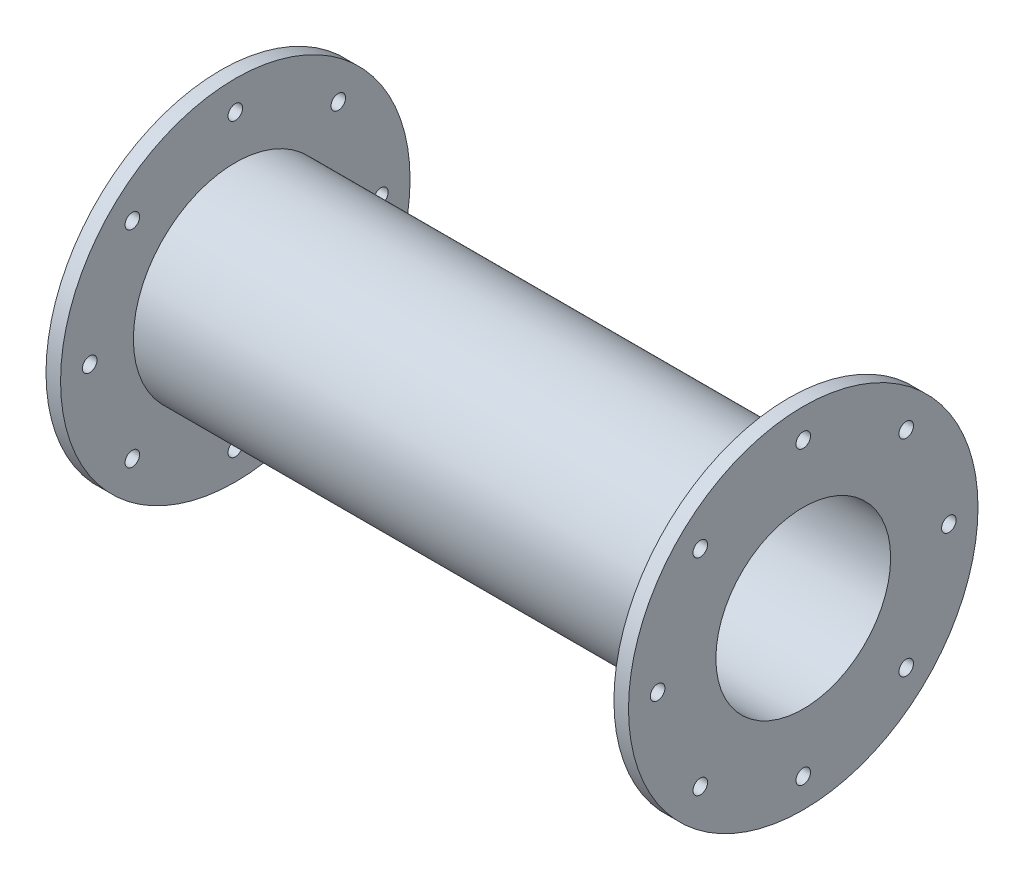
ISO-10303-21;
HEADER;
FILE_DESCRIPTION(('STEP AP214'),'2;1');
FILE_NAME('part.step','',(''),(''),'','','');
FILE_SCHEMA(('AUTOMOTIVE_DESIGN { 1 0 10303 214 1 1 1 1 }'));
ENDSEC;
DATA;
#1=APPLICATION_CONTEXT('core data for automotive mechanical design processes');
#2=APPLICATION_PROTOCOL_DEFINITION('international standard','automotive_design',2000,#1);
#3=PRODUCT_CONTEXT('',#1,'mechanical');
#4=PRODUCT('Part','Part','',(#3));
#5=PRODUCT_RELATED_PRODUCT_CATEGORY('part','',(#4));
#6=PRODUCT_DEFINITION_FORMATION('','',#4);
#7=PRODUCT_DEFINITION_CONTEXT('part definition',#1,'design');
#8=PRODUCT_DEFINITION('design','',#6,#7);
#9=PRODUCT_DEFINITION_SHAPE('','',#8);
#10=(LENGTH_UNIT() NAMED_UNIT(*) SI_UNIT(.MILLI.,.METRE.));
#11=(NAMED_UNIT(*) PLANE_ANGLE_UNIT() SI_UNIT($,.RADIAN.));
#12=(NAMED_UNIT(*) SI_UNIT($,.STERADIAN.) SOLID_ANGLE_UNIT());
#13=UNCERTAINTY_MEASURE_WITH_UNIT(LENGTH_MEASURE(1.E-05),#10,'distance_accuracy_value','');
#14=(GEOMETRIC_REPRESENTATION_CONTEXT(3) GLOBAL_UNCERTAINTY_ASSIGNED_CONTEXT((#13)) GLOBAL_UNIT_ASSIGNED_CONTEXT((#10,
#11,#12)) REPRESENTATION_CONTEXT('',''));
#15=CARTESIAN_POINT('',(0.,0.,0.));
#16=DIRECTION('',(0.,0.,1.));
#17=DIRECTION('',(1.,0.,0.));
#18=AXIS2_PLACEMENT_3D('',#15,#16,#17);
#19=CARTESIAN_POINT('',(-152.49,0.,0.));
#20=DIRECTION('',(-1.,0.,0.));
#21=DIRECTION('',(0.,0.,1.));
#22=AXIS2_PLACEMENT_3D('',#19,#20,#21);
#23=CYLINDRICAL_SURFACE('',#22,38.1);
#24=CARTESIAN_POINT('',(-3.17499999999998,0.,0.));
#25=DIRECTION('',(-1.,0.,0.));
#26=DIRECTION('',(0.,0.,1.));
#27=AXIS2_PLACEMENT_3D('',#24,#25,#26);
#28=CIRCLE('',#27,38.1);
#29=CARTESIAN_POINT('',(-3.17499999999998,0.,38.1));
#30=VERTEX_POINT('',#29);
#31=EDGE_CURVE('E72',#30,#30,#28,.T.);
#32=ORIENTED_EDGE('',*,*,#31,.F.);
#33=EDGE_LOOP('',(#32));
#34=FACE_BOUND('',#33,.T.);
#35=CARTESIAN_POINT('',(0.,0.,0.));
#36=DIRECTION('',(-1.,0.,0.));
#37=DIRECTION('',(0.,0.,1.));
#38=AXIS2_PLACEMENT_3D('',#35,#36,#37);
#39=CIRCLE('',#38,38.1);
#40=CARTESIAN_POINT('',(0.,0.,38.1));
#41=VERTEX_POINT('',#40);
#42=EDGE_CURVE('E10',#41,#41,#39,.T.);
#43=ORIENTED_EDGE('',*,*,#42,.T.);
#44=EDGE_LOOP('',(#43));
#45=FACE_BOUND('',#44,.T.);
#46=ADVANCED_FACE('F37',(#34,#45),#23,.T.);
#47=CARTESIAN_POINT('',(0.,38.1,0.));
#48=DIRECTION('',(-1.,0.,0.));
#49=DIRECTION('',(0.,0.,1.));
#50=AXIS2_PLACEMENT_3D('',#47,#48,#49);
#51=PLANE('',#50);
#52=CARTESIAN_POINT('',(0.,-1.10854532508269E-13,31.75));
#53=DIRECTION('',(1.,0.,0.));
#54=DIRECTION('',(0.,1.,0.));
#55=AXIS2_PLACEMENT_3D('',#52,#53,#54);
#56=CIRCLE('',#55,1.58749999999999);
#57=CARTESIAN_POINT('',(0.,1.58749999999988,31.75));
#58=VERTEX_POINT('',#57);
#59=EDGE_CURVE('E179',#58,#58,#56,.T.);
#60=ORIENTED_EDGE('',*,*,#59,.F.);
#61=EDGE_LOOP('',(#60));
#62=FACE_BOUND('',#61,.T.);
#63=CARTESIAN_POINT('',(0.,-22.450640302673,22.4506403026728));
#64=DIRECTION('',(1.,0.,0.));
#65=DIRECTION('',(0.,0.707106781186544,0.707106781186551));
#66=AXIS2_PLACEMENT_3D('',#63,#64,#65);
#67=CIRCLE('',#66,1.58749999999999);
#68=CARTESIAN_POINT('',(0.,-21.3281082875394,23.5731723178064));
#69=VERTEX_POINT('',#68);
#70=EDGE_CURVE('E171',#69,#69,#67,.T.);
#71=ORIENTED_EDGE('',*,*,#70,.F.);
#72=EDGE_LOOP('',(#71));
#73=FACE_BOUND('',#72,.T.);
#74=CARTESIAN_POINT('',(0.,-31.75,0.));
#75=DIRECTION('',(1.,0.,0.));
#76=DIRECTION('',(0.,0.,1.));
#77=AXIS2_PLACEMENT_3D('',#74,#75,#76);
#78=CIRCLE('',#77,1.58749999999999);
#79=CARTESIAN_POINT('',(0.,-31.75,1.58749999999999));
#80=VERTEX_POINT('',#79);
#81=EDGE_CURVE('E161',#80,#80,#78,.T.);
#82=ORIENTED_EDGE('',*,*,#81,.F.);
#83=EDGE_LOOP('',(#82));
#84=FACE_BOUND('',#83,.T.);
#85=CARTESIAN_POINT('',(0.,-22.4506403026727,-22.4506403026731));
#86=DIRECTION('',(1.,0.,0.));
#87=DIRECTION('',(0.,-0.707106781186554,0.707106781186541));
#88=AXIS2_PLACEMENT_3D('',#85,#86,#87);
#89=CIRCLE('',#88,1.58749999999999);
#90=CARTESIAN_POINT('',(0.,-23.5731723178063,-21.3281082875395));
#91=VERTEX_POINT('',#90);
#92=EDGE_CURVE('E162',#91,#91,#89,.T.);
#93=ORIENTED_EDGE('',*,*,#92,.F.);
#94=EDGE_LOOP('',(#93));
#95=FACE_BOUND('',#94,.T.);
#96=CARTESIAN_POINT('',(0.,3.32563597524808E-13,-31.75));
#97=DIRECTION('',(1.,0.,0.));
#98=DIRECTION('',(0.,-1.,0.));
#99=AXIS2_PLACEMENT_3D('',#96,#97,#98);
#100=CIRCLE('',#99,1.58749999999999);
#101=CARTESIAN_POINT('',(0.,-1.58749999999966,-31.75));
#102=VERTEX_POINT('',#101);
#103=EDGE_CURVE('E193',#102,#102,#100,.T.);
#104=ORIENTED_EDGE('',*,*,#103,.F.);
#105=EDGE_LOOP('',(#104));
#106=FACE_BOUND('',#105,.T.);
#107=CARTESIAN_POINT('',(0.,22.4506403026732,-22.4506403026726));
#108=DIRECTION('',(1.,0.,0.));
#109=DIRECTION('',(0.,-0.707106781186539,-0.707106781186556));
#110=AXIS2_PLACEMENT_3D('',#107,#108,#109);
#111=CIRCLE('',#110,1.58749999999999);
#112=CARTESIAN_POINT('',(0.,21.3281082875395,-23.5731723178063));
#113=VERTEX_POINT('',#112);
#114=EDGE_CURVE('E194',#113,#113,#111,.T.);
#115=ORIENTED_EDGE('',*,*,#114,.F.);
#116=EDGE_LOOP('',(#115));
#117=FACE_BOUND('',#116,.T.);
#118=CARTESIAN_POINT('',(0.,22.4506403026728,22.4506403026729));
#119=DIRECTION('',(1.,0.,0.));
#120=DIRECTION('',(0.,0.707106781186549,-0.707106781186546));
#121=AXIS2_PLACEMENT_3D('',#118,#119,#120);
#122=CIRCLE('',#121,1.58749999999999);
#123=CARTESIAN_POINT('',(0.,23.5731723178065,21.3281082875393));
#124=VERTEX_POINT('',#123);
#125=EDGE_CURVE('E152',#124,#124,#122,.T.);
#126=ORIENTED_EDGE('',*,*,#125,.F.);
#127=EDGE_LOOP('',(#126));
#128=FACE_BOUND('',#127,.T.);
#129=CARTESIAN_POINT('',(0.,31.75,0.));
#130=DIRECTION('',(1.,0.,0.));
#131=DIRECTION('',(0.,0.,-1.));
#132=AXIS2_PLACEMENT_3D('',#129,#130,#131);
#133=CIRCLE('',#132,1.58749999999999);
#134=CARTESIAN_POINT('',(0.,31.75,-1.58749999999999));
#135=VERTEX_POINT('',#134);
#136=EDGE_CURVE('E88',#135,#135,#133,.T.);
#137=ORIENTED_EDGE('',*,*,#136,.F.);
#138=EDGE_LOOP('',(#137));
#139=FACE_BOUND('',#138,.T.);
#140=ORIENTED_EDGE('',*,*,#42,.F.);
#141=EDGE_LOOP('',(#140));
#142=FACE_BOUND('',#141,.T.);
#143=CARTESIAN_POINT('',(0.,0.,0.));
#144=DIRECTION('',(-1.,0.,0.));
#145=DIRECTION('',(0.,0.,1.));
#146=AXIS2_PLACEMENT_3D('',#143,#144,#145);
#147=CIRCLE('',#146,19.05);
#148=CARTESIAN_POINT('',(0.,0.,19.05));
#149=VERTEX_POINT('',#148);
#150=EDGE_CURVE('E44',#149,#149,#147,.T.);
#151=ORIENTED_EDGE('',*,*,#150,.T.);
#152=EDGE_LOOP('',(#151));
#153=FACE_BOUND('',#152,.T.);
#154=ADVANCED_FACE('F208',(#62,#73,#84,#95,#106,#117,#128,#139,#142,#153),#51,.F.);
#155=CARTESIAN_POINT('',(-152.49,0.,0.));
#156=DIRECTION('',(-1.,0.,0.));
#157=DIRECTION('',(0.,0.,1.));
#158=AXIS2_PLACEMENT_3D('',#155,#156,#157);
#159=CYLINDRICAL_SURFACE('',#158,19.05);
#160=ORIENTED_EDGE('',*,*,#150,.F.);
#161=EDGE_LOOP('',(#160));
#162=FACE_BOUND('',#161,.T.);
#163=CARTESIAN_POINT('',(-127.,0.,0.));
#164=DIRECTION('',(-1.,0.,0.));
#165=DIRECTION('',(0.,0.,1.));
#166=AXIS2_PLACEMENT_3D('',#163,#164,#165);
#167=CIRCLE('',#166,19.05);
#168=CARTESIAN_POINT('',(-127.,0.,19.05));
#169=VERTEX_POINT('',#168);
#170=EDGE_CURVE('E49',#169,#169,#167,.T.);
#171=ORIENTED_EDGE('',*,*,#170,.T.);
#172=EDGE_LOOP('',(#171));
#173=FACE_BOUND('',#172,.T.);
#174=ADVANCED_FACE('F211',(#162,#173),#159,.F.);
#175=CARTESIAN_POINT('',(-127.,19.05,0.));
#176=DIRECTION('',(1.,0.,0.));
#177=DIRECTION('',(0.,0.,-1.));
#178=AXIS2_PLACEMENT_3D('',#175,#176,#177);
#179=PLANE('',#178);
#180=CARTESIAN_POINT('',(-127.,-1.10854532508269E-13,31.75));
#181=DIRECTION('',(1.,0.,0.));
#182=DIRECTION('',(0.,1.,0.));
#183=AXIS2_PLACEMENT_3D('',#180,#181,#182);
#184=CIRCLE('',#183,1.58749999999998);
#185=CARTESIAN_POINT('',(-127.,1.58749999999987,31.75));
#186=VERTEX_POINT('',#185);
#187=EDGE_CURVE('E123',#186,#186,#184,.T.);
#188=ORIENTED_EDGE('',*,*,#187,.T.);
#189=EDGE_LOOP('',(#188));
#190=FACE_BOUND('',#189,.T.);
#191=CARTESIAN_POINT('',(-127.,-22.450640302673,22.4506403026728));
#192=DIRECTION('',(1.,0.,0.));
#193=DIRECTION('',(0.,0.707106781186544,0.707106781186551));
#194=AXIS2_PLACEMENT_3D('',#191,#192,#193);
#195=CIRCLE('',#194,1.58749999999998);
#196=CARTESIAN_POINT('',(-127.,-21.3281082875394,23.5731723178064));
#197=VERTEX_POINT('',#196);
#198=EDGE_CURVE('E115',#197,#197,#195,.T.);
#199=ORIENTED_EDGE('',*,*,#198,.T.);
#200=EDGE_LOOP('',(#199));
#201=FACE_BOUND('',#200,.T.);
#202=CARTESIAN_POINT('',(-127.,-31.75,0.));
#203=DIRECTION('',(1.,0.,0.));
#204=DIRECTION('',(0.,0.,1.));
#205=AXIS2_PLACEMENT_3D('',#202,#203,#204);
#206=CIRCLE('',#205,1.58749999999998);
#207=CARTESIAN_POINT('',(-127.,-31.75,1.58749999999998));
#208=VERTEX_POINT('',#207);
#209=EDGE_CURVE('E105',#208,#208,#206,.T.);
#210=ORIENTED_EDGE('',*,*,#209,.T.);
#211=EDGE_LOOP('',(#210));
#212=FACE_BOUND('',#211,.T.);
#213=CARTESIAN_POINT('',(-127.,-22.4506403026727,-22.4506403026731));
#214=DIRECTION('',(1.,0.,0.));
#215=DIRECTION('',(0.,-0.707106781186554,0.707106781186541));
#216=AXIS2_PLACEMENT_3D('',#213,#214,#215);
#217=CIRCLE('',#216,1.58749999999998);
#218=CARTESIAN_POINT('',(-127.,-23.5731723178063,-21.3281082875395));
#219=VERTEX_POINT('',#218);
#220=EDGE_CURVE('E106',#219,#219,#217,.T.);
#221=ORIENTED_EDGE('',*,*,#220,.T.);
#222=EDGE_LOOP('',(#221));
#223=FACE_BOUND('',#222,.T.);
#224=CARTESIAN_POINT('',(-127.,3.32563597524808E-13,-31.75));
#225=DIRECTION('',(1.,0.,0.));
#226=DIRECTION('',(0.,-1.,0.));
#227=AXIS2_PLACEMENT_3D('',#224,#225,#226);
#228=CIRCLE('',#227,1.58749999999998);
#229=CARTESIAN_POINT('',(-127.,-1.58749999999965,-31.75));
#230=VERTEX_POINT('',#229);
#231=EDGE_CURVE('E137',#230,#230,#228,.T.);
#232=ORIENTED_EDGE('',*,*,#231,.T.);
#233=EDGE_LOOP('',(#232));
#234=FACE_BOUND('',#233,.T.);
#235=CARTESIAN_POINT('',(-127.,22.4506403026732,-22.4506403026726));
#236=DIRECTION('',(1.,0.,0.));
#237=DIRECTION('',(0.,-0.707106781186539,-0.707106781186556));
#238=AXIS2_PLACEMENT_3D('',#235,#236,#237);
#239=CIRCLE('',#238,1.58749999999998);
#240=CARTESIAN_POINT('',(-127.,21.3281082875395,-23.5731723178063));
#241=VERTEX_POINT('',#240);
#242=EDGE_CURVE('E138',#241,#241,#239,.T.);
#243=ORIENTED_EDGE('',*,*,#242,.T.);
#244=EDGE_LOOP('',(#243));
#245=FACE_BOUND('',#244,.T.);
#246=CARTESIAN_POINT('',(-127.,22.4506403026728,22.4506403026729));
#247=DIRECTION('',(1.,0.,0.));
#248=DIRECTION('',(0.,0.707106781186549,-0.707106781186546));
#249=AXIS2_PLACEMENT_3D('',#246,#247,#248);
#250=CIRCLE('',#249,1.58749999999998);
#251=CARTESIAN_POINT('',(-127.,23.5731723178065,21.3281082875393));
#252=VERTEX_POINT('',#251);
#253=EDGE_CURVE('E96',#252,#252,#250,.T.);
#254=ORIENTED_EDGE('',*,*,#253,.T.);
#255=EDGE_LOOP('',(#254));
#256=FACE_BOUND('',#255,.T.);
#257=CARTESIAN_POINT('',(-127.,31.75,0.));
#258=DIRECTION('',(1.,0.,0.));
#259=DIRECTION('',(0.,0.,-1.));
#260=AXIS2_PLACEMENT_3D('',#257,#258,#259);
#261=CIRCLE('',#260,1.58749999999998);
#262=CARTESIAN_POINT('',(-127.,31.75,-1.58749999999998));
#263=VERTEX_POINT('',#262);
#264=EDGE_CURVE('E84',#263,#263,#261,.T.);
#265=ORIENTED_EDGE('',*,*,#264,.T.);
#266=EDGE_LOOP('',(#265));
#267=FACE_BOUND('',#266,.T.);
#268=ORIENTED_EDGE('',*,*,#170,.F.);
#269=EDGE_LOOP('',(#268));
#270=FACE_BOUND('',#269,.T.);
#271=CARTESIAN_POINT('',(-127.,0.,0.));
#272=DIRECTION('',(-1.,0.,0.));
#273=DIRECTION('',(0.,0.,1.));
#274=AXIS2_PLACEMENT_3D('',#271,#272,#273);
#275=CIRCLE('',#274,38.1);
#276=CARTESIAN_POINT('',(-127.,0.,38.1));
#277=VERTEX_POINT('',#276);
#278=EDGE_CURVE('E54',#277,#277,#275,.T.);
#279=ORIENTED_EDGE('',*,*,#278,.T.);
#280=EDGE_LOOP('',(#279));
#281=FACE_BOUND('',#280,.T.);
#282=ADVANCED_FACE('F252',(#190,#201,#212,#223,#234,#245,#256,#267,#270,#281),#179,.F.);
#283=CARTESIAN_POINT('',(-152.49,0.,0.));
#284=DIRECTION('',(-1.,0.,0.));
#285=DIRECTION('',(0.,0.,1.));
#286=AXIS2_PLACEMENT_3D('',#283,#284,#285);
#287=CYLINDRICAL_SURFACE('',#286,38.1);
#288=ORIENTED_EDGE('',*,*,#278,.F.);
#289=EDGE_LOOP('',(#288));
#290=FACE_BOUND('',#289,.T.);
#291=CARTESIAN_POINT('',(-123.825,0.,0.));
#292=DIRECTION('',(-1.,0.,0.));
#293=DIRECTION('',(0.,0.,1.));
#294=AXIS2_PLACEMENT_3D('',#291,#292,#293);
#295=CIRCLE('',#294,38.1);
#296=CARTESIAN_POINT('',(-123.825,0.,38.1));
#297=VERTEX_POINT('',#296);
#298=EDGE_CURVE('E60',#297,#297,#295,.T.);
#299=ORIENTED_EDGE('',*,*,#298,.T.);
#300=EDGE_LOOP('',(#299));
#301=FACE_BOUND('',#300,.T.);
#302=ADVANCED_FACE('F260',(#290,#301),#287,.T.);
#303=CARTESIAN_POINT('',(-123.825,38.1,0.));
#304=DIRECTION('',(-1.,0.,0.));
#305=DIRECTION('',(0.,0.,1.));
#306=AXIS2_PLACEMENT_3D('',#303,#304,#305);
#307=PLANE('',#306);
#308=CARTESIAN_POINT('',(-123.825,-1.10854532508269E-13,31.75));
#309=DIRECTION('',(-1.,0.,0.));
#310=DIRECTION('',(0.,-1.,0.));
#311=AXIS2_PLACEMENT_3D('',#308,#309,#310);
#312=CIRCLE('',#311,1.58749999999999);
#313=CARTESIAN_POINT('',(-123.825,-1.5875000000001,31.75));
#314=VERTEX_POINT('',#313);
#315=EDGE_CURVE('E100',#314,#314,#312,.T.);
#316=ORIENTED_EDGE('',*,*,#315,.T.);
#317=EDGE_LOOP('',(#316));
#318=FACE_BOUND('',#317,.T.);
#319=CARTESIAN_POINT('',(-123.825,-22.450640302673,22.4506403026728));
#320=DIRECTION('',(-1.,0.,0.));
#321=DIRECTION('',(0.,-0.707106781186544,-0.707106781186551));
#322=AXIS2_PLACEMENT_3D('',#319,#320,#321);
#323=CIRCLE('',#322,1.58749999999999);
#324=CARTESIAN_POINT('',(-123.825,-23.5731723178066,21.3281082875391));
#325=VERTEX_POINT('',#324);
#326=EDGE_CURVE('E119',#325,#325,#323,.T.);
#327=ORIENTED_EDGE('',*,*,#326,.T.);
#328=EDGE_LOOP('',(#327));
#329=FACE_BOUND('',#328,.T.);
#330=CARTESIAN_POINT('',(-123.825,-31.75,0.));
#331=DIRECTION('',(-1.,0.,0.));
#332=DIRECTION('',(0.,0.,-1.));
#333=AXIS2_PLACEMENT_3D('',#330,#331,#332);
#334=CIRCLE('',#333,1.58749999999999);
#335=CARTESIAN_POINT('',(-123.825,-31.75,-1.58749999999999));
#336=VERTEX_POINT('',#335);
#337=EDGE_CURVE('E111',#336,#336,#334,.T.);
#338=ORIENTED_EDGE('',*,*,#337,.T.);
#339=EDGE_LOOP('',(#338));
#340=FACE_BOUND('',#339,.T.);
#341=CARTESIAN_POINT('',(-123.825,-22.4506403026727,-22.4506403026731));
#342=DIRECTION('',(-1.,0.,0.));
#343=DIRECTION('',(0.,0.707106781186554,-0.707106781186541));
#344=AXIS2_PLACEMENT_3D('',#341,#342,#343);
#345=CIRCLE('',#344,1.58749999999999);
#346=CARTESIAN_POINT('',(-123.825,-21.328108287539,-23.5731723178067));
#347=VERTEX_POINT('',#346);
#348=EDGE_CURVE('E101',#347,#347,#345,.T.);
#349=ORIENTED_EDGE('',*,*,#348,.T.);
#350=EDGE_LOOP('',(#349));
#351=FACE_BOUND('',#350,.T.);
#352=CARTESIAN_POINT('',(-123.825,3.32563597524808E-13,-31.75));
#353=DIRECTION('',(-1.,0.,0.));
#354=DIRECTION('',(0.,1.,0.));
#355=AXIS2_PLACEMENT_3D('',#352,#353,#354);
#356=CIRCLE('',#355,1.58749999999999);
#357=CARTESIAN_POINT('',(-123.825,1.58750000000032,-31.75));
#358=VERTEX_POINT('',#357);
#359=EDGE_CURVE('E110',#358,#358,#356,.T.);
#360=ORIENTED_EDGE('',*,*,#359,.T.);
#361=EDGE_LOOP('',(#360));
#362=FACE_BOUND('',#361,.T.);
#363=CARTESIAN_POINT('',(-123.825,22.4506403026732,-22.4506403026726));
#364=DIRECTION('',(-1.,0.,0.));
#365=DIRECTION('',(0.,0.707106781186539,0.707106781186556));
#366=AXIS2_PLACEMENT_3D('',#363,#364,#365);
#367=CIRCLE('',#366,1.58749999999999);
#368=CARTESIAN_POINT('',(-123.825,23.5731723178068,-21.328108287539));
#369=VERTEX_POINT('',#368);
#370=EDGE_CURVE('E133',#369,#369,#367,.T.);
#371=ORIENTED_EDGE('',*,*,#370,.T.);
#372=EDGE_LOOP('',(#371));
#373=FACE_BOUND('',#372,.T.);
#374=CARTESIAN_POINT('',(-123.825,22.4506403026728,22.4506403026729));
#375=DIRECTION('',(-1.,0.,0.));
#376=DIRECTION('',(0.,-0.707106781186549,0.707106781186546));
#377=AXIS2_PLACEMENT_3D('',#374,#375,#376);
#378=CIRCLE('',#377,1.58749999999999);
#379=CARTESIAN_POINT('',(-123.825,21.3281082875392,23.5731723178066));
#380=VERTEX_POINT('',#379);
#381=EDGE_CURVE('E92',#380,#380,#378,.T.);
#382=ORIENTED_EDGE('',*,*,#381,.T.);
#383=EDGE_LOOP('',(#382));
#384=FACE_BOUND('',#383,.T.);
#385=CARTESIAN_POINT('',(-123.825,31.75,0.));
#386=DIRECTION('',(-1.,0.,0.));
#387=DIRECTION('',(0.,0.,1.));
#388=AXIS2_PLACEMENT_3D('',#385,#386,#387);
#389=CIRCLE('',#388,1.58749999999999);
#390=CARTESIAN_POINT('',(-123.825,31.75,1.58749999999999));
#391=VERTEX_POINT('',#390);
#392=EDGE_CURVE('E76',#391,#391,#389,.T.);
#393=ORIENTED_EDGE('',*,*,#392,.T.);
#394=EDGE_LOOP('',(#393));
#395=FACE_BOUND('',#394,.T.);
#396=ORIENTED_EDGE('',*,*,#298,.F.);
#397=EDGE_LOOP('',(#396));
#398=FACE_BOUND('',#397,.T.);
#399=CARTESIAN_POINT('',(-123.825,0.,0.));
#400=DIRECTION('',(-1.,0.,0.));
#401=DIRECTION('',(0.,0.,1.));
#402=AXIS2_PLACEMENT_3D('',#399,#400,#401);
#403=CIRCLE('',#402,22.225);
#404=CARTESIAN_POINT('',(-123.825,0.,22.225));
#405=VERTEX_POINT('',#404);
#406=EDGE_CURVE('E64',#405,#405,#403,.T.);
#407=ORIENTED_EDGE('',*,*,#406,.T.);
#408=EDGE_LOOP('',(#407));
#409=FACE_BOUND('',#408,.T.);
#410=ADVANCED_FACE('F268',(#318,#329,#340,#351,#362,#373,#384,#395,#398,#409),#307,.F.);
#411=CARTESIAN_POINT('',(-152.49,0.,0.));
#412=DIRECTION('',(-1.,0.,0.));
#413=DIRECTION('',(0.,0.,1.));
#414=AXIS2_PLACEMENT_3D('',#411,#412,#413);
#415=CYLINDRICAL_SURFACE('',#414,22.225);
#416=ORIENTED_EDGE('',*,*,#406,.F.);
#417=EDGE_LOOP('',(#416));
#418=FACE_BOUND('',#417,.T.);
#419=CARTESIAN_POINT('',(-3.17499999999998,0.,0.));
#420=DIRECTION('',(-1.,0.,0.));
#421=DIRECTION('',(0.,0.,1.));
#422=AXIS2_PLACEMENT_3D('',#419,#420,#421);
#423=CIRCLE('',#422,22.225);
#424=CARTESIAN_POINT('',(-3.17499999999998,0.,22.225));
#425=VERTEX_POINT('',#424);
#426=EDGE_CURVE('E68',#425,#425,#423,.T.);
#427=ORIENTED_EDGE('',*,*,#426,.T.);
#428=EDGE_LOOP('',(#427));
#429=FACE_BOUND('',#428,.T.);
#430=ADVANCED_FACE('F230',(#418,#429),#415,.T.);
#431=CARTESIAN_POINT('',(-3.17499999999999,22.225,0.));
#432=DIRECTION('',(1.,0.,0.));
#433=DIRECTION('',(0.,0.,-1.));
#434=AXIS2_PLACEMENT_3D('',#431,#432,#433);
#435=PLANE('',#434);
#436=CARTESIAN_POINT('',(-3.17499999999999,-1.10854532508269E-13,31.75));
#437=DIRECTION('',(1.,0.,0.));
#438=DIRECTION('',(0.,1.,0.));
#439=AXIS2_PLACEMENT_3D('',#436,#437,#438);
#440=CIRCLE('',#439,1.58749999999999);
#441=CARTESIAN_POINT('',(-3.17499999999999,1.58749999999988,31.75));
#442=VERTEX_POINT('',#441);
#443=EDGE_CURVE('E156',#442,#442,#440,.T.);
#444=ORIENTED_EDGE('',*,*,#443,.T.);
#445=EDGE_LOOP('',(#444));
#446=FACE_BOUND('',#445,.T.);
#447=CARTESIAN_POINT('',(-3.17499999999999,-22.450640302673,22.4506403026728));
#448=DIRECTION('',(1.,0.,0.));
#449=DIRECTION('',(0.,0.707106781186544,0.707106781186551));
#450=AXIS2_PLACEMENT_3D('',#447,#448,#449);
#451=CIRCLE('',#450,1.58749999999999);
#452=CARTESIAN_POINT('',(-3.17499999999999,-21.3281082875394,23.5731723178064));
#453=VERTEX_POINT('',#452);
#454=EDGE_CURVE('E175',#453,#453,#451,.T.);
#455=ORIENTED_EDGE('',*,*,#454,.T.);
#456=EDGE_LOOP('',(#455));
#457=FACE_BOUND('',#456,.T.);
#458=CARTESIAN_POINT('',(-3.17499999999999,-31.75,0.));
#459=DIRECTION('',(1.,0.,0.));
#460=DIRECTION('',(0.,0.,1.));
#461=AXIS2_PLACEMENT_3D('',#458,#459,#460);
#462=CIRCLE('',#461,1.58749999999999);
#463=CARTESIAN_POINT('',(-3.17499999999999,-31.75,1.58749999999999));
#464=VERTEX_POINT('',#463);
#465=EDGE_CURVE('E167',#464,#464,#462,.T.);
#466=ORIENTED_EDGE('',*,*,#465,.T.);
#467=EDGE_LOOP('',(#466));
#468=FACE_BOUND('',#467,.T.);
#469=CARTESIAN_POINT('',(-3.17499999999999,-22.4506403026727,-22.4506403026731));
#470=DIRECTION('',(1.,0.,0.));
#471=DIRECTION('',(0.,-0.707106781186554,0.707106781186541));
#472=AXIS2_PLACEMENT_3D('',#469,#470,#471);
#473=CIRCLE('',#472,1.58749999999999);
#474=CARTESIAN_POINT('',(-3.17499999999999,-23.5731723178063,-21.3281082875395));
#475=VERTEX_POINT('',#474);
#476=EDGE_CURVE('E157',#475,#475,#473,.T.);
#477=ORIENTED_EDGE('',*,*,#476,.T.);
#478=EDGE_LOOP('',(#477));
#479=FACE_BOUND('',#478,.T.);
#480=CARTESIAN_POINT('',(-3.17499999999999,3.32563597524808E-13,-31.75));
#481=DIRECTION('',(1.,0.,0.));
#482=DIRECTION('',(0.,-1.,0.));
#483=AXIS2_PLACEMENT_3D('',#480,#481,#482);
#484=CIRCLE('',#483,1.58749999999999);
#485=CARTESIAN_POINT('',(-3.17499999999999,-1.58749999999966,-31.75));
#486=VERTEX_POINT('',#485);
#487=EDGE_CURVE('E166',#486,#486,#484,.T.);
#488=ORIENTED_EDGE('',*,*,#487,.T.);
#489=EDGE_LOOP('',(#488));
#490=FACE_BOUND('',#489,.T.);
#491=CARTESIAN_POINT('',(-3.17499999999999,22.4506403026732,-22.4506403026726));
#492=DIRECTION('',(1.,0.,0.));
#493=DIRECTION('',(0.,-0.707106781186539,-0.707106781186556));
#494=AXIS2_PLACEMENT_3D('',#491,#492,#493);
#495=CIRCLE('',#494,1.58749999999999);
#496=CARTESIAN_POINT('',(-3.17499999999999,21.3281082875395,-23.5731723178063));
#497=VERTEX_POINT('',#496);
#498=EDGE_CURVE('E189',#497,#497,#495,.T.);
#499=ORIENTED_EDGE('',*,*,#498,.T.);
#500=EDGE_LOOP('',(#499));
#501=FACE_BOUND('',#500,.T.);
#502=CARTESIAN_POINT('',(-3.17499999999999,22.4506403026728,22.4506403026729));
#503=DIRECTION('',(1.,0.,0.));
#504=DIRECTION('',(0.,0.707106781186549,-0.707106781186546));
#505=AXIS2_PLACEMENT_3D('',#502,#503,#504);
#506=CIRCLE('',#505,1.58749999999999);
#507=CARTESIAN_POINT('',(-3.17499999999999,23.5731723178065,21.3281082875393));
#508=VERTEX_POINT('',#507);
#509=EDGE_CURVE('E142',#508,#508,#506,.T.);
#510=ORIENTED_EDGE('',*,*,#509,.T.);
#511=EDGE_LOOP('',(#510));
#512=FACE_BOUND('',#511,.T.);
#513=CARTESIAN_POINT('',(-3.17499999999999,31.75,0.));
#514=DIRECTION('',(1.,0.,0.));
#515=DIRECTION('',(0.,0.,-1.));
#516=AXIS2_PLACEMENT_3D('',#513,#514,#515);
#517=CIRCLE('',#516,1.58749999999999);
#518=CARTESIAN_POINT('',(-3.17499999999999,31.75,-1.58749999999999));
#519=VERTEX_POINT('',#518);
#520=EDGE_CURVE('E80',#519,#519,#517,.T.);
#521=ORIENTED_EDGE('',*,*,#520,.T.);
#522=EDGE_LOOP('',(#521));
#523=FACE_BOUND('',#522,.T.);
#524=ORIENTED_EDGE('',*,*,#426,.F.);
#525=EDGE_LOOP('',(#524));
#526=FACE_BOUND('',#525,.T.);
#527=ORIENTED_EDGE('',*,*,#31,.T.);
#528=EDGE_LOOP('',(#527));
#529=FACE_BOUND('',#528,.T.);
#530=ADVANCED_FACE('F224',(#446,#457,#468,#479,#490,#501,#512,#523,#526,#529),#435,.F.);
#531=CARTESIAN_POINT('',(0.,31.75,0.));
#532=DIRECTION('',(1.,0.,0.));
#533=DIRECTION('',(0.,0.,-1.));
#534=AXIS2_PLACEMENT_3D('',#531,#532,#533);
#535=CYLINDRICAL_SURFACE('',#534,1.58749999999999);
#536=ORIENTED_EDGE('',*,*,#136,.T.);
#537=EDGE_LOOP('',(#536));
#538=FACE_BOUND('',#537,.T.);
#539=ORIENTED_EDGE('',*,*,#520,.F.);
#540=EDGE_LOOP('',(#539));
#541=FACE_BOUND('',#540,.T.);
#542=ADVANCED_FACE('F220',(#538,#541),#535,.F.);
#543=ORIENTED_EDGE('',*,*,#264,.F.);
#544=EDGE_LOOP('',(#543));
#545=FACE_BOUND('',#544,.T.);
#546=ORIENTED_EDGE('',*,*,#392,.F.);
#547=EDGE_LOOP('',(#546));
#548=FACE_BOUND('',#547,.T.);
#549=ADVANCED_FACE('F223',(#545,#548),#535,.F.);
#550=CARTESIAN_POINT('',(0.,22.4506403026728,22.4506403026729));
#551=DIRECTION('',(1.,0.,0.));
#552=DIRECTION('',(0.,0.707106781186549,-0.707106781186546));
#553=AXIS2_PLACEMENT_3D('',#550,#551,#552);
#554=CYLINDRICAL_SURFACE('',#553,1.58749999999999);
#555=ORIENTED_EDGE('',*,*,#253,.F.);
#556=EDGE_LOOP('',(#555));
#557=FACE_BOUND('',#556,.T.);
#558=ORIENTED_EDGE('',*,*,#381,.F.);
#559=EDGE_LOOP('',(#558));
#560=FACE_BOUND('',#559,.T.);
#561=ADVANCED_FACE('F297',(#557,#560),#554,.F.);
#562=CARTESIAN_POINT('',(0.,22.4506403026732,-22.4506403026726));
#563=DIRECTION('',(1.,0.,0.));
#564=DIRECTION('',(0.,-0.707106781186539,-0.707106781186556));
#565=AXIS2_PLACEMENT_3D('',#562,#563,#564);
#566=CYLINDRICAL_SURFACE('',#565,1.58749999999999);
#567=ORIENTED_EDGE('',*,*,#242,.F.);
#568=EDGE_LOOP('',(#567));
#569=FACE_BOUND('',#568,.T.);
#570=ORIENTED_EDGE('',*,*,#370,.F.);
#571=EDGE_LOOP('',(#570));
#572=FACE_BOUND('',#571,.T.);
#573=ADVANCED_FACE('F303',(#569,#572),#566,.F.);
#574=CARTESIAN_POINT('',(0.,3.32563597524808E-13,-31.75));
#575=DIRECTION('',(1.,0.,0.));
#576=DIRECTION('',(0.,-1.,0.));
#577=AXIS2_PLACEMENT_3D('',#574,#575,#576);
#578=CYLINDRICAL_SURFACE('',#577,1.58749999999999);
#579=ORIENTED_EDGE('',*,*,#231,.F.);
#580=EDGE_LOOP('',(#579));
#581=FACE_BOUND('',#580,.T.);
#582=ORIENTED_EDGE('',*,*,#359,.F.);
#583=EDGE_LOOP('',(#582));
#584=FACE_BOUND('',#583,.T.);
#585=ADVANCED_FACE('F311',(#581,#584),#578,.F.);
#586=CARTESIAN_POINT('',(0.,-22.4506403026727,-22.4506403026731));
#587=DIRECTION('',(1.,0.,0.));
#588=DIRECTION('',(0.,-0.707106781186554,0.707106781186541));
#589=AXIS2_PLACEMENT_3D('',#586,#587,#588);
#590=CYLINDRICAL_SURFACE('',#589,1.58749999999999);
#591=ORIENTED_EDGE('',*,*,#220,.F.);
#592=EDGE_LOOP('',(#591));
#593=FACE_BOUND('',#592,.T.);
#594=ORIENTED_EDGE('',*,*,#348,.F.);
#595=EDGE_LOOP('',(#594));
#596=FACE_BOUND('',#595,.T.);
#597=ADVANCED_FACE('F319',(#593,#596),#590,.F.);
#598=CARTESIAN_POINT('',(0.,-31.75,0.));
#599=DIRECTION('',(1.,0.,0.));
#600=DIRECTION('',(0.,0.,1.));
#601=AXIS2_PLACEMENT_3D('',#598,#599,#600);
#602=CYLINDRICAL_SURFACE('',#601,1.58749999999999);
#603=ORIENTED_EDGE('',*,*,#209,.F.);
#604=EDGE_LOOP('',(#603));
#605=FACE_BOUND('',#604,.T.);
#606=ORIENTED_EDGE('',*,*,#337,.F.);
#607=EDGE_LOOP('',(#606));
#608=FACE_BOUND('',#607,.T.);
#609=ADVANCED_FACE('F327',(#605,#608),#602,.F.);
#610=CARTESIAN_POINT('',(0.,-22.450640302673,22.4506403026728));
#611=DIRECTION('',(1.,0.,0.));
#612=DIRECTION('',(0.,0.707106781186544,0.707106781186551));
#613=AXIS2_PLACEMENT_3D('',#610,#611,#612);
#614=CYLINDRICAL_SURFACE('',#613,1.58749999999999);
#615=ORIENTED_EDGE('',*,*,#198,.F.);
#616=EDGE_LOOP('',(#615));
#617=FACE_BOUND('',#616,.T.);
#618=ORIENTED_EDGE('',*,*,#326,.F.);
#619=EDGE_LOOP('',(#618));
#620=FACE_BOUND('',#619,.T.);
#621=ADVANCED_FACE('F335',(#617,#620),#614,.F.);
#622=CARTESIAN_POINT('',(0.,-1.10854532508269E-13,31.75));
#623=DIRECTION('',(1.,0.,0.));
#624=DIRECTION('',(0.,1.,0.));
#625=AXIS2_PLACEMENT_3D('',#622,#623,#624);
#626=CYLINDRICAL_SURFACE('',#625,1.58749999999999);
#627=ORIENTED_EDGE('',*,*,#187,.F.);
#628=EDGE_LOOP('',(#627));
#629=FACE_BOUND('',#628,.T.);
#630=ORIENTED_EDGE('',*,*,#315,.F.);
#631=EDGE_LOOP('',(#630));
#632=FACE_BOUND('',#631,.T.);
#633=ADVANCED_FACE('F343',(#629,#632),#626,.F.);
#634=CARTESIAN_POINT('',(0.,22.4506403026728,22.4506403026729));
#635=DIRECTION('',(1.,0.,0.));
#636=DIRECTION('',(0.,0.707106781186549,-0.707106781186546));
#637=AXIS2_PLACEMENT_3D('',#634,#635,#636);
#638=CYLINDRICAL_SURFACE('',#637,1.58749999999999);
#639=ORIENTED_EDGE('',*,*,#125,.T.);
#640=EDGE_LOOP('',(#639));
#641=FACE_BOUND('',#640,.T.);
#642=ORIENTED_EDGE('',*,*,#509,.F.);
#643=EDGE_LOOP('',(#642));
#644=FACE_BOUND('',#643,.T.);
#645=ADVANCED_FACE('F351',(#641,#644),#638,.F.);
#646=CARTESIAN_POINT('',(0.,22.4506403026732,-22.4506403026726));
#647=DIRECTION('',(1.,0.,0.));
#648=DIRECTION('',(0.,-0.707106781186539,-0.707106781186556));
#649=AXIS2_PLACEMENT_3D('',#646,#647,#648);
#650=CYLINDRICAL_SURFACE('',#649,1.58749999999999);
#651=ORIENTED_EDGE('',*,*,#114,.T.);
#652=EDGE_LOOP('',(#651));
#653=FACE_BOUND('',#652,.T.);
#654=ORIENTED_EDGE('',*,*,#498,.F.);
#655=EDGE_LOOP('',(#654));
#656=FACE_BOUND('',#655,.T.);
#657=ADVANCED_FACE('F359',(#653,#656),#650,.F.);
#658=CARTESIAN_POINT('',(0.,3.32563597524808E-13,-31.75));
#659=DIRECTION('',(1.,0.,0.));
#660=DIRECTION('',(0.,-1.,0.));
#661=AXIS2_PLACEMENT_3D('',#658,#659,#660);
#662=CYLINDRICAL_SURFACE('',#661,1.58749999999999);
#663=ORIENTED_EDGE('',*,*,#103,.T.);
#664=EDGE_LOOP('',(#663));
#665=FACE_BOUND('',#664,.T.);
#666=ORIENTED_EDGE('',*,*,#487,.F.);
#667=EDGE_LOOP('',(#666));
#668=FACE_BOUND('',#667,.T.);
#669=ADVANCED_FACE('F205',(#665,#668),#662,.F.);
#670=CARTESIAN_POINT('',(0.,-22.4506403026727,-22.4506403026731));
#671=DIRECTION('',(1.,0.,0.));
#672=DIRECTION('',(0.,-0.707106781186554,0.707106781186541));
#673=AXIS2_PLACEMENT_3D('',#670,#671,#672);
#674=CYLINDRICAL_SURFACE('',#673,1.58749999999999);
#675=ORIENTED_EDGE('',*,*,#92,.T.);
#676=EDGE_LOOP('',(#675));
#677=FACE_BOUND('',#676,.T.);
#678=ORIENTED_EDGE('',*,*,#476,.F.);
#679=EDGE_LOOP('',(#678));
#680=FACE_BOUND('',#679,.T.);
#681=ADVANCED_FACE('F374',(#677,#680),#674,.F.);
#682=CARTESIAN_POINT('',(0.,-31.75,0.));
#683=DIRECTION('',(1.,0.,0.));
#684=DIRECTION('',(0.,0.,1.));
#685=AXIS2_PLACEMENT_3D('',#682,#683,#684);
#686=CYLINDRICAL_SURFACE('',#685,1.58749999999999);
#687=ORIENTED_EDGE('',*,*,#81,.T.);
#688=EDGE_LOOP('',(#687));
#689=FACE_BOUND('',#688,.T.);
#690=ORIENTED_EDGE('',*,*,#465,.F.);
#691=EDGE_LOOP('',(#690));
#692=FACE_BOUND('',#691,.T.);
#693=ADVANCED_FACE('F381',(#689,#692),#686,.F.);
#694=CARTESIAN_POINT('',(0.,-22.450640302673,22.4506403026728));
#695=DIRECTION('',(1.,0.,0.));
#696=DIRECTION('',(0.,0.707106781186544,0.707106781186551));
#697=AXIS2_PLACEMENT_3D('',#694,#695,#696);
#698=CYLINDRICAL_SURFACE('',#697,1.58749999999999);
#699=ORIENTED_EDGE('',*,*,#70,.T.);
#700=EDGE_LOOP('',(#699));
#701=FACE_BOUND('',#700,.T.);
#702=ORIENTED_EDGE('',*,*,#454,.F.);
#703=EDGE_LOOP('',(#702));
#704=FACE_BOUND('',#703,.T.);
#705=ADVANCED_FACE('F389',(#701,#704),#698,.F.);
#706=CARTESIAN_POINT('',(0.,-1.10854532508269E-13,31.75));
#707=DIRECTION('',(1.,0.,0.));
#708=DIRECTION('',(0.,1.,0.));
#709=AXIS2_PLACEMENT_3D('',#706,#707,#708);
#710=CYLINDRICAL_SURFACE('',#709,1.58749999999999);
#711=ORIENTED_EDGE('',*,*,#59,.T.);
#712=EDGE_LOOP('',(#711));
#713=FACE_BOUND('',#712,.T.);
#714=ORIENTED_EDGE('',*,*,#443,.F.);
#715=EDGE_LOOP('',(#714));
#716=FACE_BOUND('',#715,.T.);
#717=ADVANCED_FACE('F397',(#713,#716),#710,.F.);
#718=CLOSED_SHELL('',(#46,#154,#174,#282,#302,#410,#430,#530,#542,#549,#561,#573,#585,#597,#609,
#621,#633,#645,#657,#669,#681,#693,#705,#717));
#719=MANIFOLD_SOLID_BREP('B2',#718);
#720=ADVANCED_BREP_SHAPE_REPRESENTATION('',(#18,#719),#14);
#721=SHAPE_DEFINITION_REPRESENTATION(#9,#720);
ENDSEC;
END-ISO-10303-21;
